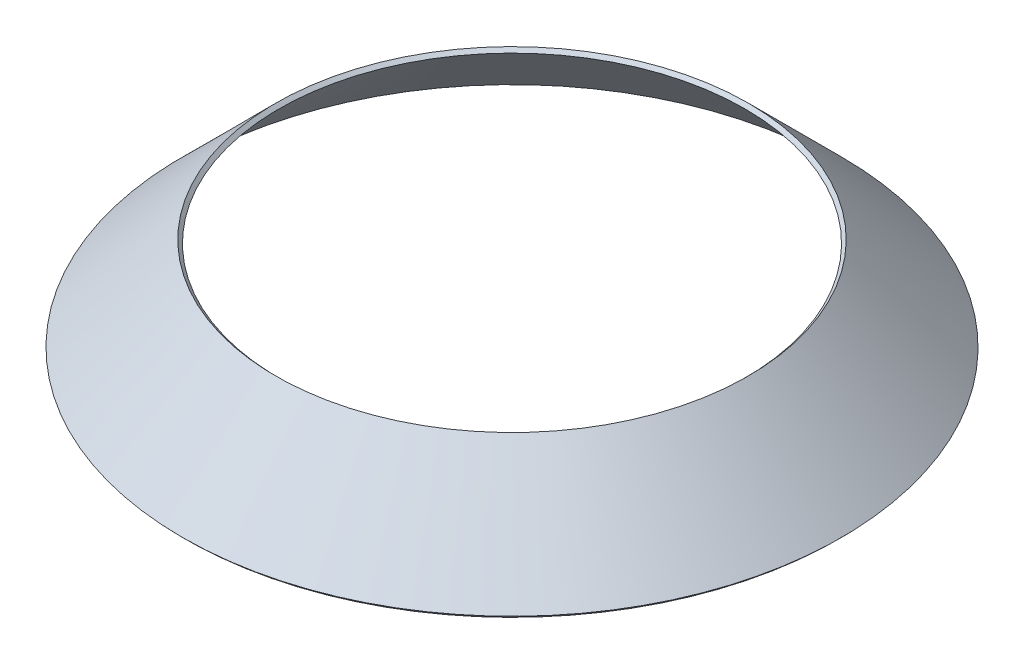
ISO-10303-21;
HEADER;
FILE_DESCRIPTION(('STEP AP214'),'2;1');
FILE_NAME('part.step','',(''),(''),'','','');
FILE_SCHEMA(('AUTOMOTIVE_DESIGN { 1 0 10303 214 1 1 1 1 }'));
ENDSEC;
DATA;
#1=APPLICATION_CONTEXT('core data for automotive mechanical design processes');
#2=APPLICATION_PROTOCOL_DEFINITION('international standard','automotive_design',2000,#1);
#3=PRODUCT_CONTEXT('',#1,'mechanical');
#4=PRODUCT('Part','Part','',(#3));
#5=PRODUCT_RELATED_PRODUCT_CATEGORY('part','',(#4));
#6=PRODUCT_DEFINITION_FORMATION('','',#4);
#7=PRODUCT_DEFINITION_CONTEXT('part definition',#1,'design');
#8=PRODUCT_DEFINITION('design','',#6,#7);
#9=PRODUCT_DEFINITION_SHAPE('','',#8);
#10=(LENGTH_UNIT() NAMED_UNIT(*) SI_UNIT(.MILLI.,.METRE.));
#11=(NAMED_UNIT(*) PLANE_ANGLE_UNIT() SI_UNIT($,.RADIAN.));
#12=(NAMED_UNIT(*) SI_UNIT($,.STERADIAN.) SOLID_ANGLE_UNIT());
#13=UNCERTAINTY_MEASURE_WITH_UNIT(LENGTH_MEASURE(1.E-05),#10,'distance_accuracy_value','');
#14=(GEOMETRIC_REPRESENTATION_CONTEXT(3) GLOBAL_UNCERTAINTY_ASSIGNED_CONTEXT((#13)) GLOBAL_UNIT_ASSIGNED_CONTEXT((#10,
#11,#12)) REPRESENTATION_CONTEXT('',''));
#15=CARTESIAN_POINT('',(0.,0.,0.));
#16=DIRECTION('',(0.,0.,1.));
#17=DIRECTION('',(1.,0.,0.));
#18=AXIS2_PLACEMENT_3D('',#15,#16,#17);
#19=CARTESIAN_POINT('',(0.,1.05744447133094,0.));
#20=DIRECTION('',(0.,1.,0.));
#21=DIRECTION('',(0.,0.,1.));
#22=AXIS2_PLACEMENT_3D('',#19,#20,#21);
#23=CONICAL_SURFACE('',#22,5.07071067811865,0.785398163397447);
#24=CARTESIAN_POINT('',(0.,0.986733793212288,0.));
#25=DIRECTION('',(0.,-1.,0.));
#26=DIRECTION('',(0.,0.,-1.));
#27=AXIS2_PLACEMENT_3D('',#24,#25,#26);
#28=CIRCLE('',#27,5.);
#29=CARTESIAN_POINT('',(0.,0.986733793212288,-5.));
#30=VERTEX_POINT('',#29);
#31=EDGE_CURVE('E47',#30,#30,#28,.T.);
#32=ORIENTED_EDGE('',*,*,#31,.T.);
#33=EDGE_LOOP('',(#32));
#34=FACE_BOUND('',#33,.T.);
#35=CARTESIAN_POINT('',(0.,1.05744447133094,0.));
#36=DIRECTION('',(0.,-1.,0.));
#37=DIRECTION('',(0.,0.,-1.));
#38=AXIS2_PLACEMENT_3D('',#35,#36,#37);
#39=CIRCLE('',#38,5.07071067811865);
#40=CARTESIAN_POINT('',(0.,1.05744447133094,-5.07071067811865));
#41=VERTEX_POINT('',#40);
#42=EDGE_CURVE('E10',#41,#41,#39,.T.);
#43=ORIENTED_EDGE('',*,*,#42,.F.);
#44=EDGE_LOOP('',(#43));
#45=FACE_BOUND('',#44,.T.);
#46=ADVANCED_FACE('F33',(#34,#45),#23,.F.);
#47=CARTESIAN_POINT('',(0.,-0.942555528669057,0.));
#48=DIRECTION('',(0.,-1.,0.));
#49=DIRECTION('',(0.,0.,-1.));
#50=AXIS2_PLACEMENT_3D('',#47,#48,#49);
#51=CONICAL_SURFACE('',#50,7.07071067811865,0.785398163397448);
#52=ORIENTED_EDGE('',*,*,#42,.T.);
#53=EDGE_LOOP('',(#52));
#54=FACE_BOUND('',#53,.T.);
#55=CARTESIAN_POINT('',(0.,-0.942555528669057,0.));
#56=DIRECTION('',(0.,-1.,0.));
#57=DIRECTION('',(0.,0.,-1.));
#58=AXIS2_PLACEMENT_3D('',#55,#56,#57);
#59=CIRCLE('',#58,7.07071067811865);
#60=CARTESIAN_POINT('',(0.,-0.942555528669057,-7.07071067811865));
#61=VERTEX_POINT('',#60);
#62=EDGE_CURVE('E39',#61,#61,#59,.T.);
#63=ORIENTED_EDGE('',*,*,#62,.F.);
#64=EDGE_LOOP('',(#63));
#65=FACE_BOUND('',#64,.T.);
#66=ADVANCED_FACE('F63',(#54,#65),#51,.T.);
#67=CARTESIAN_POINT('',(0.,-1.01326620678771,0.));
#68=DIRECTION('',(0.,1.,0.));
#69=DIRECTION('',(0.,0.,1.));
#70=AXIS2_PLACEMENT_3D('',#67,#68,#69);
#71=CONICAL_SURFACE('',#70,7.,0.785398163397445);
#72=ORIENTED_EDGE('',*,*,#62,.T.);
#73=EDGE_LOOP('',(#72));
#74=FACE_BOUND('',#73,.T.);
#75=CARTESIAN_POINT('',(0.,-1.01326620678771,0.));
#76=DIRECTION('',(0.,-1.,0.));
#77=DIRECTION('',(0.,0.,-1.));
#78=AXIS2_PLACEMENT_3D('',#75,#76,#77);
#79=CIRCLE('',#78,7.);
#80=CARTESIAN_POINT('',(0.,-1.01326620678771,-7.));
#81=VERTEX_POINT('',#80);
#82=EDGE_CURVE('E43',#81,#81,#79,.T.);
#83=ORIENTED_EDGE('',*,*,#82,.F.);
#84=EDGE_LOOP('',(#83));
#85=FACE_BOUND('',#84,.T.);
#86=ADVANCED_FACE('F57',(#74,#85),#71,.T.);
#87=CARTESIAN_POINT('',(0.,0.986733793212288,0.));
#88=DIRECTION('',(0.,-1.,0.));
#89=DIRECTION('',(0.,0.,-1.));
#90=AXIS2_PLACEMENT_3D('',#87,#88,#89);
#91=CONICAL_SURFACE('',#90,5.,0.785398163397448);
#92=ORIENTED_EDGE('',*,*,#82,.T.);
#93=EDGE_LOOP('',(#92));
#94=FACE_BOUND('',#93,.T.);
#95=ORIENTED_EDGE('',*,*,#31,.F.);
#96=EDGE_LOOP('',(#95));
#97=FACE_BOUND('',#96,.T.);
#98=ADVANCED_FACE('F55',(#94,#97),#91,.F.);
#99=CLOSED_SHELL('',(#46,#66,#86,#98));
#100=MANIFOLD_SOLID_BREP('B2',#99);
#101=ADVANCED_BREP_SHAPE_REPRESENTATION('',(#18,#100),#14);
#102=SHAPE_DEFINITION_REPRESENTATION(#9,#101);
ENDSEC;
END-ISO-10303-21;
